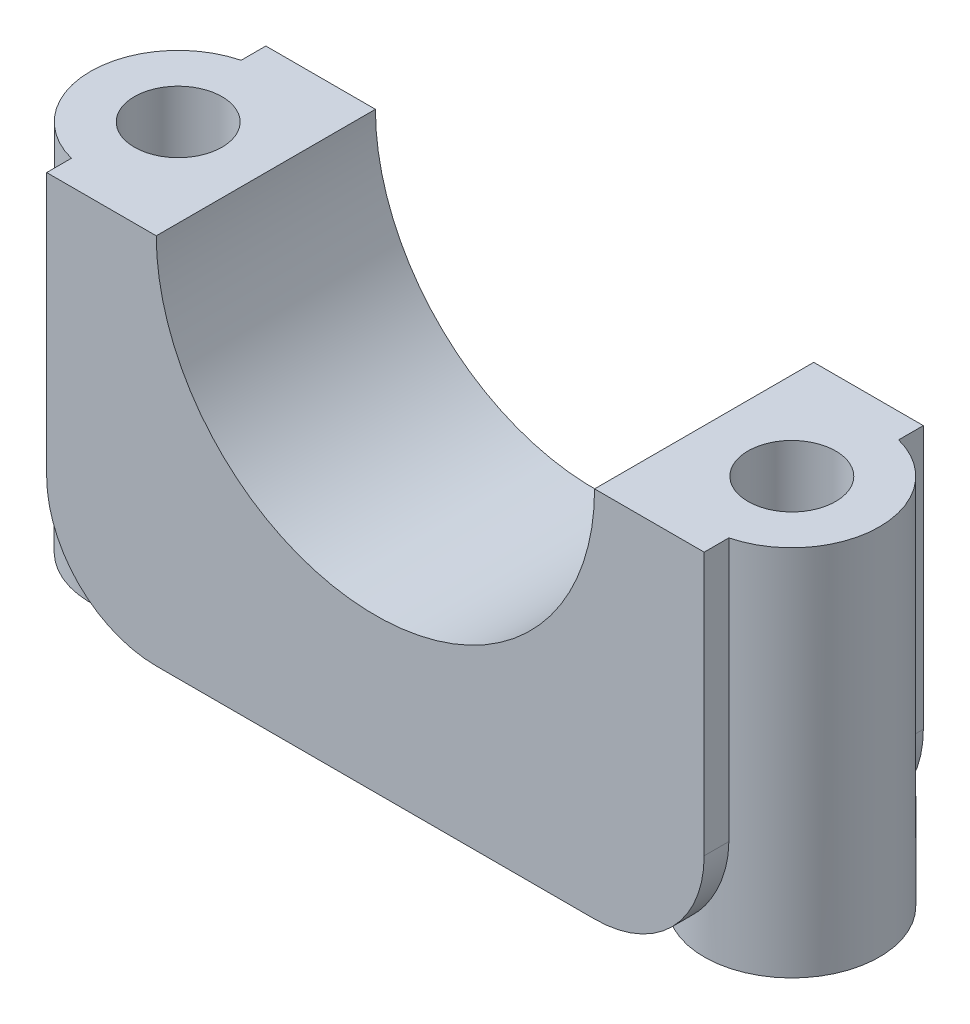
ISO-10303-21;
HEADER;
FILE_DESCRIPTION(('STEP AP214'),'2;1');
FILE_NAME('part.step','',(''),(''),'','','');
FILE_SCHEMA(('AUTOMOTIVE_DESIGN { 1 0 10303 214 1 1 1 1 }'));
ENDSEC;
DATA;
#1=APPLICATION_CONTEXT('core data for automotive mechanical design processes');
#2=APPLICATION_PROTOCOL_DEFINITION('international standard','automotive_design',2000,#1);
#3=PRODUCT_CONTEXT('',#1,'mechanical');
#4=PRODUCT('Part','Part','',(#3));
#5=PRODUCT_RELATED_PRODUCT_CATEGORY('part','',(#4));
#6=PRODUCT_DEFINITION_FORMATION('','',#4);
#7=PRODUCT_DEFINITION_CONTEXT('part definition',#1,'design');
#8=PRODUCT_DEFINITION('design','',#6,#7);
#9=PRODUCT_DEFINITION_SHAPE('','',#8);
#10=(LENGTH_UNIT() NAMED_UNIT(*) SI_UNIT(.MILLI.,.METRE.));
#11=(NAMED_UNIT(*) PLANE_ANGLE_UNIT() SI_UNIT($,.RADIAN.));
#12=(NAMED_UNIT(*) SI_UNIT($,.STERADIAN.) SOLID_ANGLE_UNIT());
#13=UNCERTAINTY_MEASURE_WITH_UNIT(LENGTH_MEASURE(1.E-05),#10,'distance_accuracy_value','');
#14=(GEOMETRIC_REPRESENTATION_CONTEXT(3) GLOBAL_UNCERTAINTY_ASSIGNED_CONTEXT((#13)) GLOBAL_UNIT_ASSIGNED_CONTEXT((#10,
#11,#12)) REPRESENTATION_CONTEXT('',''));
#15=CARTESIAN_POINT('',(0.,0.,0.));
#16=DIRECTION('',(0.,0.,1.));
#17=DIRECTION('',(1.,0.,0.));
#18=AXIS2_PLACEMENT_3D('',#15,#16,#17);
#19=CARTESIAN_POINT('',(0.,0.,0.));
#20=DIRECTION('',(0.,1.,0.));
#21=DIRECTION('',(0.,0.,1.));
#22=AXIS2_PLACEMENT_3D('',#19,#20,#21);
#23=PLANE('',#22);
#24=DIRECTION('',(0.,0.,-1.));
#25=VECTOR('',#24,1.);
#26=CARTESIAN_POINT('',(-10.,0.,10.));
#27=LINE('',#26,#25);
#28=CARTESIAN_POINT('',(-10.,0.,0.));
#29=VERTEX_POINT('',#28);
#30=CARTESIAN_POINT('',(-10.,0.,10.));
#31=VERTEX_POINT('',#30);
#32=EDGE_CURVE('E163',#29,#31,#27,.F.);
#33=ORIENTED_EDGE('',*,*,#32,.F.);
#34=DIRECTION('',(-1.,0.,0.));
#35=VECTOR('',#34,1.);
#36=CARTESIAN_POINT('',(0.,0.,0.));
#37=LINE('',#36,#35);
#38=CARTESIAN_POINT('',(-15.,0.,0.));
#39=VERTEX_POINT('',#38);
#40=EDGE_CURVE('E149',#29,#39,#37,.T.);
#41=ORIENTED_EDGE('',*,*,#40,.T.);
#42=DIRECTION('',(0.,0.,-1.));
#43=VECTOR('',#42,1.);
#44=CARTESIAN_POINT('',(-15.,0.,0.));
#45=LINE('',#44,#43);
#46=CARTESIAN_POINT('',(-15.,0.,1.12701665379258));
#47=VERTEX_POINT('',#46);
#48=EDGE_CURVE('E236',#47,#39,#45,.T.);
#49=ORIENTED_EDGE('',*,*,#48,.F.);
#50=CARTESIAN_POINT('',(-14.,0.,5.));
#51=DIRECTION('',(0.,1.,0.));
#52=DIRECTION('',(0.,0.,1.));
#53=AXIS2_PLACEMENT_3D('',#50,#51,#52);
#54=CIRCLE('',#53,4.);
#55=CARTESIAN_POINT('',(-15.,0.,8.87298334620742));
#56=VERTEX_POINT('',#55);
#57=EDGE_CURVE('E234',#56,#47,#54,.F.);
#58=ORIENTED_EDGE('',*,*,#57,.F.);
#59=DIRECTION('',(0.,0.,-1.));
#60=VECTOR('',#59,1.);
#61=CARTESIAN_POINT('',(-15.,0.,0.));
#62=LINE('',#61,#60);
#63=CARTESIAN_POINT('',(-15.,0.,10.));
#64=VERTEX_POINT('',#63);
#65=EDGE_CURVE('E228',#64,#56,#62,.T.);
#66=ORIENTED_EDGE('',*,*,#65,.F.);
#67=DIRECTION('',(-1.,0.,0.));
#68=VECTOR('',#67,1.);
#69=CARTESIAN_POINT('',(0.,0.,10.));
#70=LINE('',#69,#68);
#71=EDGE_CURVE('E187',#31,#64,#70,.T.);
#72=ORIENTED_EDGE('',*,*,#71,.F.);
#73=EDGE_LOOP('',(#33,#41,#49,#58,#66,#72));
#74=FACE_BOUND('',#73,.T.);
#75=CARTESIAN_POINT('',(-14.,0.,5.));
#76=DIRECTION('',(0.,1.,0.));
#77=DIRECTION('',(0.,0.,1.));
#78=AXIS2_PLACEMENT_3D('',#75,#76,#77);
#79=CIRCLE('',#78,2.);
#80=CARTESIAN_POINT('',(-14.,0.,7.));
#81=VERTEX_POINT('',#80);
#82=EDGE_CURVE('E153',#81,#81,#79,.F.);
#83=ORIENTED_EDGE('',*,*,#82,.T.);
#84=EDGE_LOOP('',(#83));
#85=FACE_BOUND('',#84,.T.);
#86=ADVANCED_FACE('F34',(#74,#85),#23,.T.);
#87=CARTESIAN_POINT('',(15.,0.,0.));
#88=VERTEX_POINT('',#87);
#89=CARTESIAN_POINT('',(10.,0.,0.));
#90=VERTEX_POINT('',#89);
#91=EDGE_CURVE('E241',#88,#90,#37,.T.);
#92=ORIENTED_EDGE('',*,*,#91,.T.);
#93=DIRECTION('',(0.,0.,-1.));
#94=VECTOR('',#93,1.);
#95=CARTESIAN_POINT('',(10.,0.,10.));
#96=LINE('',#95,#94);
#97=CARTESIAN_POINT('',(10.,0.,10.));
#98=VERTEX_POINT('',#97);
#99=EDGE_CURVE('E220',#98,#90,#96,.T.);
#100=ORIENTED_EDGE('',*,*,#99,.F.);
#101=CARTESIAN_POINT('',(15.,0.,10.));
#102=VERTEX_POINT('',#101);
#103=EDGE_CURVE('E238',#102,#98,#70,.T.);
#104=ORIENTED_EDGE('',*,*,#103,.F.);
#105=DIRECTION('',(0.,0.,-1.));
#106=VECTOR('',#105,1.);
#107=CARTESIAN_POINT('',(15.,0.,0.));
#108=LINE('',#107,#106);
#109=CARTESIAN_POINT('',(15.,0.,8.87298334620743));
#110=VERTEX_POINT('',#109);
#111=EDGE_CURVE('E148',#102,#110,#108,.T.);
#112=ORIENTED_EDGE('',*,*,#111,.T.);
#113=CARTESIAN_POINT('',(14.,0.,5.00000000000001));
#114=DIRECTION('',(0.,1.,0.));
#115=DIRECTION('',(0.,0.,1.));
#116=AXIS2_PLACEMENT_3D('',#113,#114,#115);
#117=CIRCLE('',#116,4.);
#118=CARTESIAN_POINT('',(15.,0.,1.12701665379259));
#119=VERTEX_POINT('',#118);
#120=EDGE_CURVE('E131',#110,#119,#117,.T.);
#121=ORIENTED_EDGE('',*,*,#120,.T.);
#122=DIRECTION('',(0.,0.,-1.));
#123=VECTOR('',#122,1.);
#124=CARTESIAN_POINT('',(15.,0.,0.));
#125=LINE('',#124,#123);
#126=EDGE_CURVE('E146',#119,#88,#125,.T.);
#127=ORIENTED_EDGE('',*,*,#126,.T.);
#128=EDGE_LOOP('',(#92,#100,#104,#112,#121,#127));
#129=FACE_BOUND('',#128,.T.);
#130=CARTESIAN_POINT('',(14.,0.,5.00000000000001));
#131=DIRECTION('',(0.,1.,0.));
#132=DIRECTION('',(0.,0.,1.));
#133=AXIS2_PLACEMENT_3D('',#130,#131,#132);
#134=CIRCLE('',#133,2.);
#135=CARTESIAN_POINT('',(14.,0.,7.00000000000001));
#136=VERTEX_POINT('',#135);
#137=EDGE_CURVE('E231',#136,#136,#134,.T.);
#138=ORIENTED_EDGE('',*,*,#137,.F.);
#139=EDGE_LOOP('',(#138));
#140=FACE_BOUND('',#139,.T.);
#141=ADVANCED_FACE('F144',(#129,#140),#23,.T.);
#142=CARTESIAN_POINT('',(0.,-17.,10.));
#143=DIRECTION('',(0.,1.,0.));
#144=DIRECTION('',(0.,0.,1.));
#145=AXIS2_PLACEMENT_3D('',#142,#143,#144);
#146=PLANE('',#145);
#147=DIRECTION('',(0.,0.,-1.));
#148=VECTOR('',#147,1.);
#149=CARTESIAN_POINT('',(9.99999999999999,-17.,10.));
#150=LINE('',#149,#148);
#151=CARTESIAN_POINT('',(10.,-17.,0.));
#152=VERTEX_POINT('',#151);
#153=CARTESIAN_POINT('',(10.,-17.,5.00000000000001));
#154=VERTEX_POINT('',#153);
#155=EDGE_CURVE('E206',#152,#154,#150,.F.);
#156=ORIENTED_EDGE('',*,*,#155,.T.);
#157=DIRECTION('',(0.,0.,-1.));
#158=VECTOR('',#157,1.);
#159=CARTESIAN_POINT('',(9.99999999999999,-17.,10.));
#160=LINE('',#159,#158);
#161=CARTESIAN_POINT('',(9.99999999999999,-17.,10.));
#162=VERTEX_POINT('',#161);
#163=EDGE_CURVE('E203',#154,#162,#160,.F.);
#164=ORIENTED_EDGE('',*,*,#163,.T.);
#165=DIRECTION('',(1.,0.,0.));
#166=VECTOR('',#165,1.);
#167=CARTESIAN_POINT('',(0.,-17.,10.));
#168=LINE('',#167,#166);
#169=CARTESIAN_POINT('',(-10.,-17.,10.));
#170=VERTEX_POINT('',#169);
#171=EDGE_CURVE('E162',#170,#162,#168,.T.);
#172=ORIENTED_EDGE('',*,*,#171,.F.);
#173=DIRECTION('',(0.,0.,-1.));
#174=VECTOR('',#173,1.);
#175=CARTESIAN_POINT('',(-10.,-17.,8.87298334620742));
#176=LINE('',#175,#174);
#177=CARTESIAN_POINT('',(-10.,-17.,5.));
#178=VERTEX_POINT('',#177);
#179=EDGE_CURVE('E202',#170,#178,#176,.T.);
#180=ORIENTED_EDGE('',*,*,#179,.T.);
#181=DIRECTION('',(0.,0.,-1.));
#182=VECTOR('',#181,1.);
#183=CARTESIAN_POINT('',(-10.,-17.,0.));
#184=LINE('',#183,#182);
#185=CARTESIAN_POINT('',(-10.,-17.,0.));
#186=VERTEX_POINT('',#185);
#187=EDGE_CURVE('E215',#178,#186,#184,.T.);
#188=ORIENTED_EDGE('',*,*,#187,.T.);
#189=DIRECTION('',(1.,0.,0.));
#190=VECTOR('',#189,1.);
#191=CARTESIAN_POINT('',(0.,-17.,0.));
#192=LINE('',#191,#190);
#193=EDGE_CURVE('E167',#186,#152,#192,.T.);
#194=ORIENTED_EDGE('',*,*,#193,.T.);
#195=EDGE_LOOP('',(#156,#164,#172,#180,#188,#194));
#196=FACE_BOUND('',#195,.T.);
#197=ADVANCED_FACE('F291',(#196),#146,.F.);
#198=CARTESIAN_POINT('',(-14.,-17.,5.));
#199=DIRECTION('',(0.,1.,0.));
#200=DIRECTION('',(0.,0.,1.));
#201=AXIS2_PLACEMENT_3D('',#198,#199,#200);
#202=CIRCLE('',#201,3.50000000000002);
#203=CARTESIAN_POINT('',(-14.,-17.,8.50000000000002));
#204=VERTEX_POINT('',#203);
#205=EDGE_CURVE('E230',#204,#204,#202,.T.);
#206=ORIENTED_EDGE('',*,*,#205,.T.);
#207=EDGE_LOOP('',(#206));
#208=FACE_BOUND('',#207,.T.);
#209=CARTESIAN_POINT('',(-14.,-17.,5.));
#210=DIRECTION('',(0.,-1.,0.));
#211=DIRECTION('',(0.,0.,-1.));
#212=AXIS2_PLACEMENT_3D('',#209,#210,#211);
#213=CIRCLE('',#212,4.);
#214=EDGE_CURVE('E174',#178,#178,#213,.T.);
#215=ORIENTED_EDGE('',*,*,#214,.T.);
#216=EDGE_LOOP('',(#215));
#217=FACE_BOUND('',#216,.T.);
#218=ADVANCED_FACE('F287',(#208,#217),#146,.F.);
#219=CARTESIAN_POINT('',(-10.,-12.,10.));
#220=DIRECTION('',(0.,0.,1.));
#221=DIRECTION('',(1.,0.,0.));
#222=AXIS2_PLACEMENT_3D('',#219,#220,#221);
#223=CYLINDRICAL_SURFACE('',#222,5.);
#224=CARTESIAN_POINT('',(-15.,-12.,1.12701665379258));
#225=CARTESIAN_POINT('',(-15.0000000910404,-12.0696068026401,1.12701946323058));
#226=CARTESIAN_POINT('',(-14.9985462281549,-12.1392047401743,1.12664094741911));
#227=CARTESIAN_POINT('',(-14.9927357909816,-12.2782681499618,1.12514661870214));
#228=CARTESIAN_POINT('',(-14.9883793544004,-12.3477336283426,1.12403084077458));
#229=CARTESIAN_POINT('',(-14.9709698333606,-12.5556967813962,1.11961712165219));
#230=CARTESIAN_POINT('',(-14.9535765254123,-12.6938340959714,1.11525274475214));
#231=CARTESIAN_POINT('',(-14.9073537354765,-12.9681088625019,1.10419852388871));
#232=CARTESIAN_POINT('',(-14.8785206401927,-13.104245668487,1.09750794526915));
#233=CARTESIAN_POINT('',(-14.8096369542677,-13.3735764447764,1.08263758324243));
#234=CARTESIAN_POINT('',(-14.7695858013634,-13.5067702672135,1.07445772519793));
#235=CARTESIAN_POINT('',(-14.678546975161,-13.7693229910669,1.05770194457319));
#236=CARTESIAN_POINT('',(-14.627560373638,-13.898682266891,1.0491260608717));
#237=CARTESIAN_POINT('',(-14.5149689456067,-14.1527566931325,1.03288007968933));
#238=CARTESIAN_POINT('',(-14.4533642162525,-14.2774718860297,1.02520997392182));
#239=CARTESIAN_POINT('',(-14.3199731726734,-14.5213353691447,1.01225592646751));
#240=CARTESIAN_POINT('',(-14.2481953492649,-14.6404881927566,1.00697001008818));
#241=CARTESIAN_POINT('',(-14.0949044630974,-14.8724679585405,1.00039071854952));
#242=CARTESIAN_POINT('',(-14.0133936433994,-14.9852963494641,0.999096425320411));
#243=CARTESIAN_POINT('',(-13.8585050335817,-15.1818732715397,1.00191069538059));
#244=CARTESIAN_POINT('',(-13.7867592403308,-15.2669258390339,1.00499082451229));
#245=CARTESIAN_POINT('',(-13.6379166362923,-15.4318940667447,1.01572335808677));
#246=CARTESIAN_POINT('',(-13.5608210695431,-15.5118109129537,1.02337470266558));
#247=CARTESIAN_POINT('',(-13.4019159901511,-15.6659528506126,1.04415496288906));
#248=CARTESIAN_POINT('',(-13.3201097997465,-15.740181869424,1.05728005790087));
#249=CARTESIAN_POINT('',(-13.1525003820703,-15.8825025287523,1.08988094310134));
#250=CARTESIAN_POINT('',(-13.0666971191381,-15.950594114497,1.10935678995866));
#251=CARTESIAN_POINT('',(-12.8913177304467,-16.0807233276987,1.15563854435403));
#252=CARTESIAN_POINT('',(-12.8017158429579,-16.1427049137024,1.18250502320863));
#253=CARTESIAN_POINT('',(-12.6206125983011,-16.259577768715,1.24414635571148));
#254=CARTESIAN_POINT('',(-12.5291112387317,-16.3144690287591,1.27892121935852));
#255=CARTESIAN_POINT('',(-12.345608912704,-16.4169170838173,1.35679837640344));
#256=CARTESIAN_POINT('',(-12.2536082225681,-16.4644775771673,1.39989644589608));
#257=CARTESIAN_POINT('',(-12.0705151031747,-16.552282232536,1.49461759758743));
#258=CARTESIAN_POINT('',(-11.9794225608339,-16.5925273165088,1.54623960395545));
#259=CARTESIAN_POINT('',(-11.8118073072826,-16.6609448528845,1.650345211475));
#260=CARTESIAN_POINT('',(-11.7349844306416,-16.6900144162476,1.70176197829075));
#261=CARTESIAN_POINT('',(-11.5839630524176,-16.7431498252179,1.81073100179287));
#262=CARTESIAN_POINT('',(-11.5097654212197,-16.7672140239894,1.86828526841175));
#263=CARTESIAN_POINT('',(-11.3648637694408,-16.8107036523738,1.98919293130654));
#264=CARTESIAN_POINT('',(-11.2941586887419,-16.8301304965426,2.05254455100867));
#265=CARTESIAN_POINT('',(-11.1569063092012,-16.8648311010726,2.1847026045927));
#266=CARTESIAN_POINT('',(-11.0903606415868,-16.880103239827,2.25351115485381));
#267=CARTESIAN_POINT('',(-10.9621300385839,-16.906994491794,2.39605588091969));
#268=CARTESIAN_POINT('',(-10.9004402790066,-16.9186172657504,2.46978702813988));
#269=CARTESIAN_POINT('',(-10.7823402429426,-16.9387784205183,2.62177757196293));
#270=CARTESIAN_POINT('',(-10.7259318550488,-16.94731570107,2.70003857235315));
#271=CARTESIAN_POINT('',(-10.5652787185896,-16.9691210311064,2.94090229861938));
#272=CARTESIAN_POINT('',(-10.4695581383993,-16.9785916615045,3.10963890274626));
#273=CARTESIAN_POINT('',(-10.2956101821103,-16.9920950973009,3.47604587699247));
#274=CARTESIAN_POINT('',(-10.2199118186502,-16.995525171661,3.67494181828907));
#275=CARTESIAN_POINT('',(-10.1307474983346,-16.998373876894,3.98011928259906));
#276=CARTESIAN_POINT('',(-10.1050897649259,-16.998940703834,4.08298532479207));
#277=CARTESIAN_POINT('',(-10.0620190430282,-16.9996629305423,4.29041835511617));
#278=CARTESIAN_POINT('',(-10.0446027230919,-16.9998184966724,4.39498463824347));
#279=CARTESIAN_POINT('',(-10.0209133063562,-16.999967253926,4.58302779804148));
#280=CARTESIAN_POINT('',(-10.0130664046355,-16.9999877287117,4.66631137091652));
#281=CARTESIAN_POINT('',(-10.0026132155353,-16.9999999823609,4.83306094094791));
#282=CARTESIAN_POINT('',(-9.99999781635649,-16.9999918111861,4.91652636700601));
#283=CARTESIAN_POINT('',(-10.,-17.,5.));
#284=B_SPLINE_CURVE_WITH_KNOTS('',3,(#224,#225,#226,#227,#228,#229,#230,#231,#232,#233,#234,
#235,#236,#237,#238,#239,#240,#241,#242,#243,#244,#245,#246,#247,#248,#249,#250,#251,#252,#253,
#254,#255,#256,#257,#258,#259,#260,#261,#262,#263,#264,#265,#266,#267,#268,#269,#270,#271,#272,
#273,#274,#275,#276,#277,#278,#279,#280,#281,#282,#283),.UNSPECIFIED.,.F.,.F.,(4,2,2,2,2,2,2,2,
2,2,2,2,2,2,2,2,2,2,2,2,2,2,2,2,2,2,2,2,2,4),(0.,0.208786623912143,0.417563343067718,
0.834898748452077,1.2523660757381,1.66985433074987,2.08730168673589,2.50474522335971,
2.92184237677553,3.33884359105913,3.67247575428561,4.00603059288007,4.33935300156623,
4.67267838461666,5.00882145880153,5.3449649579842,5.68093831541052,6.01686930103532,
6.30722974662298,6.59768557431336,6.88805268925001,7.17853297416932,7.46872093520454,
7.75901227284997,8.3393810082535,8.97493811270393,9.29272441129358,9.61038214035736,
9.86118309002806,10.1115468336227),.UNSPECIFIED.);
#285=CARTESIAN_POINT('',(-15.,-12.,1.12701665379258));
#286=VERTEX_POINT('',#285);
#287=EDGE_CURVE('E325',#286,#178,#284,.T.);
#288=ORIENTED_EDGE('',*,*,#287,.F.);
#289=DIRECTION('',(0.,0.,-1.));
#290=VECTOR('',#289,1.);
#291=CARTESIAN_POINT('',(-15.,-12.,1.12701665379258));
#292=LINE('',#291,#290);
#293=CARTESIAN_POINT('',(-15.,-12.,0.));
#294=VERTEX_POINT('',#293);
#295=EDGE_CURVE('E197',#294,#286,#292,.F.);
#296=ORIENTED_EDGE('',*,*,#295,.F.);
#297=CARTESIAN_POINT('',(-10.,-12.,0.));
#298=DIRECTION('',(0.,0.,1.));
#299=DIRECTION('',(1.,0.,0.));
#300=AXIS2_PLACEMENT_3D('',#297,#298,#299);
#301=CIRCLE('',#300,5.);
#302=EDGE_CURVE('E370',#186,#294,#301,.F.);
#303=ORIENTED_EDGE('',*,*,#302,.F.);
#304=ORIENTED_EDGE('',*,*,#187,.F.);
#305=EDGE_LOOP('',(#288,#296,#303,#304));
#306=FACE_BOUND('',#305,.T.);
#307=ADVANCED_FACE('F290',(#306),#223,.T.);
#308=CARTESIAN_POINT('',(-15.,22.8309518948453,0.));
#309=DIRECTION('',(-1.,0.,0.));
#310=DIRECTION('',(0.,0.,1.));
#311=AXIS2_PLACEMENT_3D('',#308,#309,#310);
#312=PLANE('',#311);
#313=DIRECTION('',(0.,-1.,0.));
#314=VECTOR('',#313,1.);
#315=CARTESIAN_POINT('',(-15.,22.8309518948453,1.12701665379258));
#316=LINE('',#315,#314);
#317=EDGE_CURVE('E171',#47,#286,#316,.T.);
#318=ORIENTED_EDGE('',*,*,#317,.F.);
#319=ORIENTED_EDGE('',*,*,#48,.T.);
#320=DIRECTION('',(0.,-1.,0.));
#321=VECTOR('',#320,1.);
#322=CARTESIAN_POINT('',(-15.,22.8309518948453,0.));
#323=LINE('',#322,#321);
#324=EDGE_CURVE('E173',#39,#294,#323,.T.);
#325=ORIENTED_EDGE('',*,*,#324,.T.);
#326=ORIENTED_EDGE('',*,*,#295,.T.);
#327=EDGE_LOOP('',(#318,#319,#325,#326));
#328=FACE_BOUND('',#327,.T.);
#329=ADVANCED_FACE('F297',(#328),#312,.T.);
#330=CARTESIAN_POINT('',(14.,-17.,5.00000000000001));
#331=DIRECTION('',(0.,1.,0.));
#332=DIRECTION('',(0.,0.,1.));
#333=AXIS2_PLACEMENT_3D('',#330,#331,#332);
#334=CIRCLE('',#333,3.5);
#335=CARTESIAN_POINT('',(14.,-17.,8.50000000000001));
#336=VERTEX_POINT('',#335);
#337=EDGE_CURVE('E322',#336,#336,#334,.T.);
#338=ORIENTED_EDGE('',*,*,#337,.T.);
#339=EDGE_LOOP('',(#338));
#340=FACE_BOUND('',#339,.T.);
#341=CARTESIAN_POINT('',(14.,-17.,5.00000000000001));
#342=DIRECTION('',(0.,-1.,0.));
#343=DIRECTION('',(0.,0.,-1.));
#344=AXIS2_PLACEMENT_3D('',#341,#342,#343);
#345=CIRCLE('',#344,4.);
#346=EDGE_CURVE('E170',#154,#154,#345,.F.);
#347=ORIENTED_EDGE('',*,*,#346,.F.);
#348=EDGE_LOOP('',(#347));
#349=FACE_BOUND('',#348,.T.);
#350=ADVANCED_FACE('F283',(#340,#349),#146,.F.);
#351=CARTESIAN_POINT('',(10.,-12.,0.));
#352=DIRECTION('',(0.,0.,-1.));
#353=DIRECTION('',(-1.,0.,0.));
#354=AXIS2_PLACEMENT_3D('',#351,#352,#353);
#355=CYLINDRICAL_SURFACE('',#354,5.);
#356=CARTESIAN_POINT('',(9.99999999999999,-12.,10.));
#357=DIRECTION('',(0.,0.,1.));
#358=DIRECTION('',(1.,0.,0.));
#359=AXIS2_PLACEMENT_3D('',#356,#357,#358);
#360=CIRCLE('',#359,5.);
#361=CARTESIAN_POINT('',(15.,-12.,10.));
#362=VERTEX_POINT('',#361);
#363=EDGE_CURVE('E204',#162,#362,#360,.T.);
#364=ORIENTED_EDGE('',*,*,#363,.F.);
#365=ORIENTED_EDGE('',*,*,#163,.F.);
#366=CARTESIAN_POINT('',(15.,-12.,8.87298334620743));
#367=CARTESIAN_POINT('',(15.0000000910404,-12.0696068026401,8.87298053676943));
#368=CARTESIAN_POINT('',(14.9985462281549,-12.1392047401743,8.8733590525809));
#369=CARTESIAN_POINT('',(14.9927357909816,-12.2782681499618,8.87485338129787));
#370=CARTESIAN_POINT('',(14.9883793544004,-12.3477336283426,8.87596915922543));
#371=CARTESIAN_POINT('',(14.9709698333606,-12.5556967813962,8.88038287834781));
#372=CARTESIAN_POINT('',(14.9535765254123,-12.6938340959714,8.88474725524787));
#373=CARTESIAN_POINT('',(14.9073537354765,-12.9681088625019,8.8958014761113));
#374=CARTESIAN_POINT('',(14.8785206401927,-13.104245668487,8.90249205473086));
#375=CARTESIAN_POINT('',(14.8096369542677,-13.3735764447764,8.91736241675758));
#376=CARTESIAN_POINT('',(14.7695858013634,-13.5067702672135,8.92554227480207));
#377=CARTESIAN_POINT('',(14.678546975161,-13.7693229910669,8.94229805542682));
#378=CARTESIAN_POINT('',(14.6275603736379,-13.898682266891,8.95087393912831));
#379=CARTESIAN_POINT('',(14.5149689456067,-14.1527566931325,8.96711992031068));
#380=CARTESIAN_POINT('',(14.4533642162525,-14.2774718860297,8.97479002607819));
#381=CARTESIAN_POINT('',(14.3199731726734,-14.5213353691447,8.9877440735325));
#382=CARTESIAN_POINT('',(14.2481953492649,-14.6404881927566,8.99302998991183));
#383=CARTESIAN_POINT('',(14.0949044630974,-14.8724679585405,8.99960928145048));
#384=CARTESIAN_POINT('',(14.0133936433994,-14.9852963494641,9.0009035746796));
#385=CARTESIAN_POINT('',(13.8585050335817,-15.1818732715397,8.99808930461942));
#386=CARTESIAN_POINT('',(13.7867592403307,-15.2669258390339,8.99500917548771));
#387=CARTESIAN_POINT('',(13.6379166362923,-15.4318940667447,8.98427664191324));
#388=CARTESIAN_POINT('',(13.5608210695431,-15.5118109129537,8.97662529733443));
#389=CARTESIAN_POINT('',(13.4019159901511,-15.6659528506126,8.95584503711095));
#390=CARTESIAN_POINT('',(13.3201097997465,-15.740181869424,8.94271994209914));
#391=CARTESIAN_POINT('',(13.1525003820703,-15.8825025287523,8.91011905689866));
#392=CARTESIAN_POINT('',(13.0666971191381,-15.950594114497,8.89064321004135));
#393=CARTESIAN_POINT('',(12.8913177304467,-16.0807233276987,8.84436145564598));
#394=CARTESIAN_POINT('',(12.8017158429579,-16.1427049137024,8.81749497679137));
#395=CARTESIAN_POINT('',(12.6206125983011,-16.259577768715,8.75585364428853));
#396=CARTESIAN_POINT('',(12.5291112387317,-16.3144690287591,8.72107878064148));
#397=CARTESIAN_POINT('',(12.345608912704,-16.4169170838173,8.64320162359656));
#398=CARTESIAN_POINT('',(12.2536082225681,-16.4644775771673,8.60010355410393));
#399=CARTESIAN_POINT('',(12.0705151031747,-16.552282232536,8.50538240241258));
#400=CARTESIAN_POINT('',(11.9794225608338,-16.5925273165088,8.45376039604456));
#401=CARTESIAN_POINT('',(11.8118073072826,-16.6609448528845,8.34965478852501));
#402=CARTESIAN_POINT('',(11.7349844306416,-16.6900144162476,8.29823802170926));
#403=CARTESIAN_POINT('',(11.5839630524176,-16.7431498252179,8.18926899820714));
#404=CARTESIAN_POINT('',(11.5097654212197,-16.7672140239894,8.13171473158825));
#405=CARTESIAN_POINT('',(11.3648637694408,-16.8107036523738,8.01080706869346));
#406=CARTESIAN_POINT('',(11.2941586887418,-16.8301304965426,7.94745544899133));
#407=CARTESIAN_POINT('',(11.1569063092012,-16.8648311010726,7.8152973954073));
#408=CARTESIAN_POINT('',(11.0903606415868,-16.880103239827,7.74648884514619));
#409=CARTESIAN_POINT('',(10.9621300385839,-16.906994491794,7.60394411908031));
#410=CARTESIAN_POINT('',(10.9004402790066,-16.9186172657504,7.53021297186012));
#411=CARTESIAN_POINT('',(10.7823402429426,-16.9387784205183,7.37822242803708));
#412=CARTESIAN_POINT('',(10.7259318550488,-16.94731570107,7.29996142764686));
#413=CARTESIAN_POINT('',(10.5652787185896,-16.9691210311064,7.05909770138063));
#414=CARTESIAN_POINT('',(10.4695581383993,-16.9785916615044,6.89036109725375));
#415=CARTESIAN_POINT('',(10.2956101821103,-16.9920950973009,6.52395412300754));
#416=CARTESIAN_POINT('',(10.2199118186502,-16.995525171661,6.32505818171093));
#417=CARTESIAN_POINT('',(10.1307474983346,-16.998373876894,6.01988071740094));
#418=CARTESIAN_POINT('',(10.1050897649259,-16.998940703834,5.91701467520793));
#419=CARTESIAN_POINT('',(10.0620190430282,-16.9996629305423,5.70958164488384));
#420=CARTESIAN_POINT('',(10.0446027230919,-16.9998184966724,5.60501536175653));
#421=CARTESIAN_POINT('',(10.0209133063562,-16.999967253926,5.41697220195853));
#422=CARTESIAN_POINT('',(10.0130664046355,-16.9999877287117,5.33368862908349));
#423=CARTESIAN_POINT('',(10.0026132155353,-16.9999999823609,5.1669390590521));
#424=CARTESIAN_POINT('',(9.99999781635649,-16.9999918111861,5.08347363299399));
#425=CARTESIAN_POINT('',(10.,-17.,5.00000000000001));
#426=B_SPLINE_CURVE_WITH_KNOTS('',3,(#366,#367,#368,#369,#370,#371,#372,#373,#374,#375,#376,
#377,#378,#379,#380,#381,#382,#383,#384,#385,#386,#387,#388,#389,#390,#391,#392,#393,#394,#395,
#396,#397,#398,#399,#400,#401,#402,#403,#404,#405,#406,#407,#408,#409,#410,#411,#412,#413,#414,
#415,#416,#417,#418,#419,#420,#421,#422,#423,#424,#425),.UNSPECIFIED.,.F.,.F.,(4,2,2,2,2,2,2,2,
2,2,2,2,2,2,2,2,2,2,2,2,2,2,2,2,2,2,2,2,2,4),(0.,0.208786623912143,0.417563343067718,
0.834898748452077,1.2523660757381,1.66985433074987,2.08730168673589,2.50474522335971,
2.92184237677553,3.33884359105913,3.67247575428561,4.00603059288007,4.33935300156623,
4.67267838461666,5.00882145880153,5.3449649579842,5.68093831541052,6.01686930103532,
6.30722974662298,6.59768557431336,6.88805268925001,7.17853297416932,7.46872093520454,
7.75901227284996,8.3393810082535,8.97493811270394,9.29272441129358,9.61038214035736,
9.86118309002806,10.1115468336227),.UNSPECIFIED.);
#427=CARTESIAN_POINT('',(15.,-12.,8.87298334620743));
#428=VERTEX_POINT('',#427);
#429=EDGE_CURVE('E259',#428,#154,#426,.T.);
#430=ORIENTED_EDGE('',*,*,#429,.F.);
#431=DIRECTION('',(0.,0.,-1.));
#432=VECTOR('',#431,1.);
#433=CARTESIAN_POINT('',(15.,-12.,0.));
#434=LINE('',#433,#432);
#435=EDGE_CURVE('E218',#362,#428,#434,.T.);
#436=ORIENTED_EDGE('',*,*,#435,.F.);
#437=EDGE_LOOP('',(#364,#365,#430,#436));
#438=FACE_BOUND('',#437,.T.);
#439=ADVANCED_FACE('F257',(#438),#355,.T.);
#440=CARTESIAN_POINT('',(-10.,-12.,10.));
#441=DIRECTION('',(0.,0.,1.));
#442=DIRECTION('',(1.,0.,0.));
#443=AXIS2_PLACEMENT_3D('',#440,#441,#442);
#444=CYLINDRICAL_SURFACE('',#443,5.);
#445=CARTESIAN_POINT('',(-10.,-12.,10.));
#446=DIRECTION('',(0.,0.,1.));
#447=DIRECTION('',(1.,0.,0.));
#448=AXIS2_PLACEMENT_3D('',#445,#446,#447);
#449=CIRCLE('',#448,5.);
#450=CARTESIAN_POINT('',(-15.,-12.,10.));
#451=VERTEX_POINT('',#450);
#452=EDGE_CURVE('E183',#451,#170,#449,.T.);
#453=ORIENTED_EDGE('',*,*,#452,.F.);
#454=DIRECTION('',(0.,0.,-1.));
#455=VECTOR('',#454,1.);
#456=CARTESIAN_POINT('',(-15.,-12.,10.));
#457=LINE('',#456,#455);
#458=CARTESIAN_POINT('',(-15.,-12.,8.87298334620742));
#459=VERTEX_POINT('',#458);
#460=EDGE_CURVE('E190',#459,#451,#457,.F.);
#461=ORIENTED_EDGE('',*,*,#460,.F.);
#462=CARTESIAN_POINT('',(-10.,-17.,5.));
#463=CARTESIAN_POINT('',(-9.99998822124218,-16.9999721292244,5.11176601524956));
#464=CARTESIAN_POINT('',(-10.0046838767994,-16.999999123703,5.2235303675028));
#465=CARTESIAN_POINT('',(-10.0234052011184,-16.9999614275837,5.44627277629985));
#466=CARTESIAN_POINT('',(-10.0374306754634,-16.9998967388963,5.55725084917963));
#467=CARTESIAN_POINT('',(-10.0747423641927,-16.9994741000567,5.77773449290645));
#468=CARTESIAN_POINT('',(-10.0980363037769,-16.9991159050046,5.88723875643188));
#469=CARTESIAN_POINT('',(-10.1537159244512,-16.9977146336714,6.1039057554715));
#470=CARTESIAN_POINT('',(-10.1861014913368,-16.9966715659933,6.2110685203802));
#471=CARTESIAN_POINT('',(-10.2597584131308,-16.9933839364963,6.42236411090877));
#472=CARTESIAN_POINT('',(-10.3010360593716,-16.9911385223124,6.52649473170152));
#473=CARTESIAN_POINT('',(-10.3921699398544,-16.9848058161378,6.73092164192847));
#474=CARTESIAN_POINT('',(-10.4420291829413,-16.9807178773121,6.83121657138272));
#475=CARTESIAN_POINT('',(-10.5498796969908,-16.9699663593304,7.02710675095296));
#476=CARTESIAN_POINT('',(-10.6078654204632,-16.963304531818,7.12270514750073));
#477=CARTESIAN_POINT('',(-10.7314794488403,-16.9465973509581,7.30851062589638));
#478=CARTESIAN_POINT('',(-10.797107035867,-16.9365523152623,7.39871821295504));
#479=CARTESIAN_POINT('',(-10.9335994088482,-16.9125419833084,7.57078541839489));
#480=CARTESIAN_POINT('',(-11.0042885877563,-16.8986828673471,7.65279898302948));
#481=CARTESIAN_POINT('',(-11.1515258361838,-16.8661757684504,7.81030406900943));
#482=CARTESIAN_POINT('',(-11.2280711600846,-16.8475300201566,7.88579861184433));
#483=CARTESIAN_POINT('',(-11.3860815953541,-16.8047342414779,8.02965990486143));
#484=CARTESIAN_POINT('',(-11.4675437745936,-16.7805874682083,8.09803083810812));
#485=CARTESIAN_POINT('',(-11.6343374299454,-16.7261645005922,8.2271910762938));
#486=CARTESIAN_POINT('',(-11.7196684930146,-16.6958889593643,8.28798118797659));
#487=CARTESIAN_POINT('',(-11.8847743450382,-16.6319226062855,8.39626687502187));
#488=CARTESIAN_POINT('',(-11.9643122349183,-16.5988248531514,8.44447590279568));
#489=CARTESIAN_POINT('',(-12.1245729555588,-16.5270185545047,8.53429053173251));
#490=CARTESIAN_POINT('',(-12.2052957389182,-16.4883102328923,8.57589639626836));
#491=CARTESIAN_POINT('',(-12.3669247105626,-16.4052155112329,8.65254239457018));
#492=CARTESIAN_POINT('',(-12.4478308893459,-16.3608293990336,8.68758286096114));
#493=CARTESIAN_POINT('',(-12.6088651198048,-16.2664427927572,8.75129888416901));
#494=CARTESIAN_POINT('',(-12.6889931627533,-16.2164422357892,8.77997436967716));
#495=CARTESIAN_POINT('',(-12.8448232786205,-16.1128366484985,8.83040978535506));
#496=CARTESIAN_POINT('',(-12.9205824206015,-16.0594170897535,8.85237529048944));
#497=CARTESIAN_POINT('',(-13.0698483588886,-15.9477508919513,8.89111433326006));
#498=CARTESIAN_POINT('',(-13.1433544253583,-15.8895027109322,8.90788620421271));
#499=CARTESIAN_POINT('',(-13.3595212432978,-15.7079543654574,8.95112043894012));
#500=CARTESIAN_POINT('',(-13.4979239123643,-15.5777887650728,8.97053001696776));
#501=CARTESIAN_POINT('',(-13.7754544062025,-15.2850479946647,8.99642006946508));
#502=CARTESIAN_POINT('',(-13.9125996906286,-15.1204560401251,9.00102841404927));
#503=CARTESIAN_POINT('',(-14.1647449006176,-14.7750086913105,8.99859769336934));
#504=CARTESIAN_POINT('',(-14.279723166461,-14.5941376410199,8.9915472999423));
#505=CARTESIAN_POINT('',(-14.4444015087813,-14.2943036686896,8.9757205491533));
#506=CARTESIAN_POINT('',(-14.5018512779539,-14.1794082404466,8.96875295972883));
#507=CARTESIAN_POINT('',(-14.607724369048,-13.9455925518977,8.95392599904897));
#508=CARTESIAN_POINT('',(-14.6561494015471,-13.8266730593853,8.9460667972479));
#509=CARTESIAN_POINT('',(-14.743696354654,-13.5854963034178,8.93050808385472));
#510=CARTESIAN_POINT('',(-14.7828214944563,-13.4632402113243,8.92280851784893));
#511=CARTESIAN_POINT('',(-14.8515599813311,-13.2160682026214,8.90846195342497));
#512=CARTESIAN_POINT('',(-14.8811759153559,-13.0911530192875,8.90181466898653));
#513=CARTESIAN_POINT('',(-14.937191727298,-12.8064160939071,8.88879459540219));
#514=CARTESIAN_POINT('',(-14.9607354477639,-12.6459919512913,8.88294612879771));
#515=CARTESIAN_POINT('',(-14.9842865474507,-12.4042843016829,8.87701366976184));
#516=CARTESIAN_POINT('',(-14.9901761623747,-12.3235626510531,8.87550958449156));
#517=CARTESIAN_POINT('',(-14.9980332188916,-12.1618993505118,8.8734918643761));
#518=CARTESIAN_POINT('',(-14.9999998324211,-12.0809576577637,8.87297843863917));
#519=CARTESIAN_POINT('',(-15.,-12.,8.87298334620742));
#520=B_SPLINE_CURVE_WITH_KNOTS('',3,(#462,#463,#464,#465,#466,#467,#468,#469,#470,#471,#472,
#473,#474,#475,#476,#477,#478,#479,#480,#481,#482,#483,#484,#485,#486,#487,#488,#489,#490,#491,
#492,#493,#494,#495,#496,#497,#498,#499,#500,#501,#502,#503,#504,#505,#506,#507,#508,#509,#510,
#511,#512,#513,#514,#515,#516,#517,#518,#519),.UNSPECIFIED.,.F.,.F.,(4,2,2,2,2,2,2,2,2,2,2,2,2,
2,2,2,2,2,2,2,2,2,2,2,2,2,2,2,4),(0.,0.335197094680652,0.670387204668536,1.00585728043153,
1.34132314237672,1.677027137587,2.01284907664179,2.34844287562308,2.68400517426022,
3.0110347220633,3.33791187272177,3.66459598258526,3.99124529731524,4.28702812897907,
4.58279916012431,4.87855520246696,5.1743145580846,5.4598030729874,5.74538310898724,
6.3162005732567,6.95684793050019,7.59811813584301,7.98372406349472,8.36925682765762,
8.75465594315494,9.13995012291357,9.62579163625469,9.86855625880559,10.1113721184673),.UNSPECIFIED.);
#521=EDGE_CURVE('E263',#178,#459,#520,.T.);
#522=ORIENTED_EDGE('',*,*,#521,.F.);
#523=ORIENTED_EDGE('',*,*,#179,.F.);
#524=EDGE_LOOP('',(#453,#461,#522,#523));
#525=FACE_BOUND('',#524,.T.);
#526=ADVANCED_FACE('F200',(#525),#444,.T.);
#527=CARTESIAN_POINT('',(-14.,22.8309518948453,5.));
#528=DIRECTION('',(0.,-1.,0.));
#529=DIRECTION('',(0.,0.,-1.));
#530=AXIS2_PLACEMENT_3D('',#527,#528,#529);
#531=CYLINDRICAL_SURFACE('',#530,4.);
#532=DIRECTION('',(0.,-1.,0.));
#533=VECTOR('',#532,1.);
#534=CARTESIAN_POINT('',(-15.,22.8309518948453,8.87298334620742));
#535=LINE('',#534,#533);
#536=EDGE_CURVE('E11',#56,#459,#535,.T.);
#537=ORIENTED_EDGE('',*,*,#536,.F.);
#538=ORIENTED_EDGE('',*,*,#57,.T.);
#539=ORIENTED_EDGE('',*,*,#317,.T.);
#540=ORIENTED_EDGE('',*,*,#287,.T.);
#541=ORIENTED_EDGE('',*,*,#214,.F.);
#542=ORIENTED_EDGE('',*,*,#521,.T.);
#543=EDGE_LOOP('',(#537,#538,#539,#540,#541,#542));
#544=FACE_BOUND('',#543,.T.);
#545=ADVANCED_FACE('F301',(#544),#531,.T.);
#546=CARTESIAN_POINT('',(0.,0.,0.));
#547=DIRECTION('',(0.,0.,1.));
#548=DIRECTION('',(1.,0.,0.));
#549=AXIS2_PLACEMENT_3D('',#546,#547,#548);
#550=PLANE('',#549);
#551=ORIENTED_EDGE('',*,*,#91,.F.);
#552=DIRECTION('',(0.,-1.,0.));
#553=VECTOR('',#552,1.);
#554=CARTESIAN_POINT('',(15.,22.8309518948453,0.));
#555=LINE('',#554,#553);
#556=CARTESIAN_POINT('',(15.,-12.,0.));
#557=VERTEX_POINT('',#556);
#558=EDGE_CURVE('E139',#88,#557,#555,.T.);
#559=ORIENTED_EDGE('',*,*,#558,.T.);
#560=CARTESIAN_POINT('',(10.,-12.,0.));
#561=DIRECTION('',(0.,0.,1.));
#562=DIRECTION('',(1.,0.,0.));
#563=AXIS2_PLACEMENT_3D('',#560,#561,#562);
#564=CIRCLE('',#563,5.);
#565=EDGE_CURVE('E196',#557,#152,#564,.F.);
#566=ORIENTED_EDGE('',*,*,#565,.T.);
#567=ORIENTED_EDGE('',*,*,#193,.F.);
#568=ORIENTED_EDGE('',*,*,#302,.T.);
#569=ORIENTED_EDGE('',*,*,#324,.F.);
#570=ORIENTED_EDGE('',*,*,#40,.F.);
#571=CARTESIAN_POINT('',(0.,0.,0.));
#572=DIRECTION('',(0.,0.,1.));
#573=DIRECTION('',(1.,0.,0.));
#574=AXIS2_PLACEMENT_3D('',#571,#572,#573);
#575=CIRCLE('',#574,10.);
#576=EDGE_CURVE('E164',#29,#90,#575,.T.);
#577=ORIENTED_EDGE('',*,*,#576,.T.);
#578=EDGE_LOOP('',(#551,#559,#566,#567,#568,#569,#570,#577));
#579=FACE_BOUND('',#578,.T.);
#580=ADVANCED_FACE('F248',(#579),#550,.F.);
#581=CARTESIAN_POINT('',(0.,0.,10.));
#582=DIRECTION('',(0.,0.,1.));
#583=DIRECTION('',(1.,0.,0.));
#584=AXIS2_PLACEMENT_3D('',#581,#582,#583);
#585=PLANE('',#584);
#586=DIRECTION('',(0.,-1.,0.));
#587=VECTOR('',#586,1.);
#588=CARTESIAN_POINT('',(15.,22.8309518948453,10.));
#589=LINE('',#588,#587);
#590=EDGE_CURVE('E49',#102,#362,#589,.T.);
#591=ORIENTED_EDGE('',*,*,#590,.F.);
#592=ORIENTED_EDGE('',*,*,#103,.T.);
#593=CARTESIAN_POINT('',(0.,0.,10.));
#594=DIRECTION('',(0.,0.,1.));
#595=DIRECTION('',(1.,0.,0.));
#596=AXIS2_PLACEMENT_3D('',#593,#594,#595);
#597=CIRCLE('',#596,10.);
#598=EDGE_CURVE('E159',#31,#98,#597,.T.);
#599=ORIENTED_EDGE('',*,*,#598,.F.);
#600=ORIENTED_EDGE('',*,*,#71,.T.);
#601=DIRECTION('',(0.,-1.,0.));
#602=VECTOR('',#601,1.);
#603=CARTESIAN_POINT('',(-15.,22.8309518948453,10.));
#604=LINE('',#603,#602);
#605=EDGE_CURVE('E42',#64,#451,#604,.T.);
#606=ORIENTED_EDGE('',*,*,#605,.T.);
#607=ORIENTED_EDGE('',*,*,#452,.T.);
#608=ORIENTED_EDGE('',*,*,#171,.T.);
#609=ORIENTED_EDGE('',*,*,#363,.T.);
#610=EDGE_LOOP('',(#591,#592,#599,#600,#606,#607,#608,#609));
#611=FACE_BOUND('',#610,.T.);
#612=ADVANCED_FACE('F180',(#611),#585,.T.);
#613=CARTESIAN_POINT('',(0.,0.,10.));
#614=DIRECTION('',(0.,0.,-1.));
#615=DIRECTION('',(-1.,0.,0.));
#616=AXIS2_PLACEMENT_3D('',#613,#614,#615);
#617=CYLINDRICAL_SURFACE('',#616,10.);
#618=ORIENTED_EDGE('',*,*,#598,.T.);
#619=ORIENTED_EDGE('',*,*,#99,.T.);
#620=ORIENTED_EDGE('',*,*,#576,.F.);
#621=ORIENTED_EDGE('',*,*,#32,.T.);
#622=EDGE_LOOP('',(#618,#619,#620,#621));
#623=FACE_BOUND('',#622,.T.);
#624=ADVANCED_FACE('F252',(#623),#617,.F.);
#625=CARTESIAN_POINT('',(-15.,22.8309518948453,0.));
#626=DIRECTION('',(-1.,0.,0.));
#627=DIRECTION('',(0.,0.,1.));
#628=AXIS2_PLACEMENT_3D('',#625,#626,#627);
#629=PLANE('',#628);
#630=ORIENTED_EDGE('',*,*,#605,.F.);
#631=ORIENTED_EDGE('',*,*,#65,.T.);
#632=ORIENTED_EDGE('',*,*,#536,.T.);
#633=ORIENTED_EDGE('',*,*,#460,.T.);
#634=EDGE_LOOP('',(#630,#631,#632,#633));
#635=FACE_BOUND('',#634,.T.);
#636=ADVANCED_FACE('F191',(#635),#629,.T.);
#637=CARTESIAN_POINT('',(10.,-12.,0.));
#638=DIRECTION('',(0.,0.,-1.));
#639=DIRECTION('',(-1.,0.,0.));
#640=AXIS2_PLACEMENT_3D('',#637,#638,#639);
#641=CYLINDRICAL_SURFACE('',#640,5.);
#642=CARTESIAN_POINT('',(10.,-17.,5.00000000000001));
#643=CARTESIAN_POINT('',(9.99998822124218,-16.9999721292244,4.88823398475044));
#644=CARTESIAN_POINT('',(10.0046838767994,-16.999999123703,4.7764696324972));
#645=CARTESIAN_POINT('',(10.0234052011184,-16.9999614275837,4.55372722370015));
#646=CARTESIAN_POINT('',(10.0374306754633,-16.9998967388963,4.44274915082038));
#647=CARTESIAN_POINT('',(10.0747423641927,-16.9994741000567,4.22226550709355));
#648=CARTESIAN_POINT('',(10.0980363037769,-16.9991159050046,4.11276124356813));
#649=CARTESIAN_POINT('',(10.1537159244512,-16.9977146336714,3.89609424452851));
#650=CARTESIAN_POINT('',(10.1861014913368,-16.9966715659933,3.78893147961981));
#651=CARTESIAN_POINT('',(10.2597584131308,-16.9933839364963,3.57763588909124));
#652=CARTESIAN_POINT('',(10.3010360593716,-16.9911385223124,3.47350526829849));
#653=CARTESIAN_POINT('',(10.3921699398544,-16.9848058161378,3.26907835807154));
#654=CARTESIAN_POINT('',(10.4420291829413,-16.9807178773121,3.16878342861729));
#655=CARTESIAN_POINT('',(10.5498796969908,-16.9699663593304,2.97289324904705));
#656=CARTESIAN_POINT('',(10.6078654204632,-16.963304531818,2.87729485249928));
#657=CARTESIAN_POINT('',(10.7314794488403,-16.9465973509581,2.69148937410363));
#658=CARTESIAN_POINT('',(10.797107035867,-16.9365523152623,2.60128178704496));
#659=CARTESIAN_POINT('',(10.9335994088482,-16.9125419833084,2.42921458160512));
#660=CARTESIAN_POINT('',(11.0042885877563,-16.8986828673471,2.34720101697053));
#661=CARTESIAN_POINT('',(11.1515258361838,-16.8661757684503,2.18969593099058));
#662=CARTESIAN_POINT('',(11.2280711600846,-16.8475300201566,2.11420138815567));
#663=CARTESIAN_POINT('',(11.3860815953541,-16.8047342414779,1.97034009513858));
#664=CARTESIAN_POINT('',(11.4675437745936,-16.7805874682083,1.90196916189188));
#665=CARTESIAN_POINT('',(11.6343374299454,-16.7261645005922,1.77280892370621));
#666=CARTESIAN_POINT('',(11.7196684930146,-16.6958889593643,1.71201881202342));
#667=CARTESIAN_POINT('',(11.8847743450382,-16.6319226062855,1.60373312497814));
#668=CARTESIAN_POINT('',(11.9643122349183,-16.5988248531514,1.55552409720433));
#669=CARTESIAN_POINT('',(12.1245729555588,-16.5270185545047,1.4657094682675));
#670=CARTESIAN_POINT('',(12.2052957389182,-16.4883102328923,1.42410360373165));
#671=CARTESIAN_POINT('',(12.3669247105626,-16.4052155112329,1.34745760542983));
#672=CARTESIAN_POINT('',(12.4478308893459,-16.3608293990336,1.31241713903887));
#673=CARTESIAN_POINT('',(12.6088651198048,-16.2664427927572,1.248701115831));
#674=CARTESIAN_POINT('',(12.6889931627533,-16.2164422357892,1.22002563032285));
#675=CARTESIAN_POINT('',(12.8448232786205,-16.1128366484985,1.16959021464495));
#676=CARTESIAN_POINT('',(12.9205824206015,-16.0594170897535,1.14762470951057));
#677=CARTESIAN_POINT('',(13.0698483588886,-15.9477508919513,1.10888566673996));
#678=CARTESIAN_POINT('',(13.1433544253583,-15.8895027109322,1.0921137957873));
#679=CARTESIAN_POINT('',(13.3595212432978,-15.7079543654574,1.0488795610599));
#680=CARTESIAN_POINT('',(13.4979239123643,-15.5777887650728,1.02946998303224));
#681=CARTESIAN_POINT('',(13.7754544062025,-15.2850479946647,1.00357993053493));
#682=CARTESIAN_POINT('',(13.9125996906286,-15.1204560401251,0.998971585950742));
#683=CARTESIAN_POINT('',(14.1647449006176,-14.7750086913105,1.00140230663067));
#684=CARTESIAN_POINT('',(14.279723166461,-14.5941376410199,1.00845270005771));
#685=CARTESIAN_POINT('',(14.4444015087813,-14.2943036686896,1.02427945084671));
#686=CARTESIAN_POINT('',(14.5018512779539,-14.1794082404466,1.03124704027118));
#687=CARTESIAN_POINT('',(14.607724369048,-13.9455925518977,1.04607400095105));
#688=CARTESIAN_POINT('',(14.6561494015471,-13.8266730593853,1.05393320275211));
#689=CARTESIAN_POINT('',(14.743696354654,-13.5854963034178,1.06949191614529));
#690=CARTESIAN_POINT('',(14.7828214944563,-13.4632402113243,1.07719148215109));
#691=CARTESIAN_POINT('',(14.8515599813311,-13.2160682026214,1.09153804657504));
#692=CARTESIAN_POINT('',(14.8811759153559,-13.0911530192875,1.09818533101348));
#693=CARTESIAN_POINT('',(14.937191727298,-12.8064160939071,1.11120540459782));
#694=CARTESIAN_POINT('',(14.9607354477639,-12.6459919512913,1.1170538712023));
#695=CARTESIAN_POINT('',(14.9842865474507,-12.4042843016829,1.12298633023817));
#696=CARTESIAN_POINT('',(14.9901761623747,-12.3235626510531,1.12449041550845));
#697=CARTESIAN_POINT('',(14.9980332188916,-12.1618993505118,1.12650813562391));
#698=CARTESIAN_POINT('',(14.9999998324211,-12.0809576577637,1.12702156136084));
#699=CARTESIAN_POINT('',(15.,-12.,1.12701665379259));
#700=B_SPLINE_CURVE_WITH_KNOTS('',3,(#642,#643,#644,#645,#646,#647,#648,#649,#650,#651,#652,
#653,#654,#655,#656,#657,#658,#659,#660,#661,#662,#663,#664,#665,#666,#667,#668,#669,#670,#671,
#672,#673,#674,#675,#676,#677,#678,#679,#680,#681,#682,#683,#684,#685,#686,#687,#688,#689,#690,
#691,#692,#693,#694,#695,#696,#697,#698,#699),.UNSPECIFIED.,.F.,.F.,(4,2,2,2,2,2,2,2,2,2,2,2,2,
2,2,2,2,2,2,2,2,2,2,2,2,2,2,2,4),(0.,0.335197094680652,0.670387204668536,1.00585728043153,
1.34132314237672,1.677027137587,2.01284907664178,2.34844287562308,2.68400517426022,
3.0110347220633,3.33791187272177,3.66459598258526,3.99124529731523,4.28702812897907,
4.58279916012431,4.87855520246696,5.1743145580846,5.45980307298739,5.74538310898723,
6.31620057325669,6.95684793050019,7.59811813584301,7.98372406349471,8.36925682765762,
8.75465594315494,9.13995012291357,9.62579163625469,9.86855625880559,10.1113721184673),.UNSPECIFIED.);
#701=CARTESIAN_POINT('',(15.,-12.,1.12701665379259));
#702=VERTEX_POINT('',#701);
#703=EDGE_CURVE('E134',#154,#702,#700,.T.);
#704=ORIENTED_EDGE('',*,*,#703,.F.);
#705=ORIENTED_EDGE('',*,*,#155,.F.);
#706=ORIENTED_EDGE('',*,*,#565,.F.);
#707=DIRECTION('',(0.,0.,-1.));
#708=VECTOR('',#707,1.);
#709=CARTESIAN_POINT('',(15.,-12.,0.));
#710=LINE('',#709,#708);
#711=EDGE_CURVE('E208',#702,#557,#710,.T.);
#712=ORIENTED_EDGE('',*,*,#711,.F.);
#713=EDGE_LOOP('',(#704,#705,#706,#712));
#714=FACE_BOUND('',#713,.T.);
#715=ADVANCED_FACE('F284',(#714),#641,.T.);
#716=CARTESIAN_POINT('',(14.,22.8309518948453,5.00000000000001));
#717=DIRECTION('',(0.,-1.,0.));
#718=DIRECTION('',(0.,0.,-1.));
#719=AXIS2_PLACEMENT_3D('',#716,#717,#718);
#720=CYLINDRICAL_SURFACE('',#719,4.);
#721=ORIENTED_EDGE('',*,*,#120,.F.);
#722=DIRECTION('',(0.,-1.,0.));
#723=VECTOR('',#722,1.);
#724=CARTESIAN_POINT('',(15.,22.8309518948453,8.87298334620743));
#725=LINE('',#724,#723);
#726=EDGE_CURVE('E57',#110,#428,#725,.T.);
#727=ORIENTED_EDGE('',*,*,#726,.T.);
#728=ORIENTED_EDGE('',*,*,#429,.T.);
#729=ORIENTED_EDGE('',*,*,#346,.T.);
#730=ORIENTED_EDGE('',*,*,#703,.T.);
#731=DIRECTION('',(0.,-1.,0.));
#732=VECTOR('',#731,1.);
#733=CARTESIAN_POINT('',(15.,22.8309518948453,1.12701665379259));
#734=LINE('',#733,#732);
#735=EDGE_CURVE('E128',#119,#702,#734,.T.);
#736=ORIENTED_EDGE('',*,*,#735,.F.);
#737=EDGE_LOOP('',(#721,#727,#728,#729,#730,#736));
#738=FACE_BOUND('',#737,.T.);
#739=ADVANCED_FACE('F130',(#738),#720,.T.);
#740=CARTESIAN_POINT('',(15.,22.8309518948453,0.));
#741=DIRECTION('',(-1.,0.,0.));
#742=DIRECTION('',(0.,0.,1.));
#743=AXIS2_PLACEMENT_3D('',#740,#741,#742);
#744=PLANE('',#743);
#745=ORIENTED_EDGE('',*,*,#126,.F.);
#746=ORIENTED_EDGE('',*,*,#735,.T.);
#747=ORIENTED_EDGE('',*,*,#711,.T.);
#748=ORIENTED_EDGE('',*,*,#558,.F.);
#749=EDGE_LOOP('',(#745,#746,#747,#748));
#750=FACE_BOUND('',#749,.T.);
#751=ADVANCED_FACE('F151',(#750),#744,.F.);
#752=CARTESIAN_POINT('',(15.,22.8309518948453,0.));
#753=DIRECTION('',(-1.,0.,0.));
#754=DIRECTION('',(0.,0.,1.));
#755=AXIS2_PLACEMENT_3D('',#752,#753,#754);
#756=PLANE('',#755);
#757=ORIENTED_EDGE('',*,*,#111,.F.);
#758=ORIENTED_EDGE('',*,*,#590,.T.);
#759=ORIENTED_EDGE('',*,*,#435,.T.);
#760=ORIENTED_EDGE('',*,*,#726,.F.);
#761=EDGE_LOOP('',(#757,#758,#759,#760));
#762=FACE_BOUND('',#761,.T.);
#763=ADVANCED_FACE('F253',(#762),#756,.F.);
#764=CARTESIAN_POINT('',(14.,-17.,5.00000000000001));
#765=DIRECTION('',(0.,-1.,0.));
#766=DIRECTION('',(0.,0.,-1.));
#767=AXIS2_PLACEMENT_3D('',#764,#765,#766);
#768=CONICAL_SURFACE('',#767,3.5,0.785398163397449);
#769=CARTESIAN_POINT('',(14.,-15.5,5.00000000000001));
#770=DIRECTION('',(0.,1.,0.));
#771=DIRECTION('',(0.,0.,1.));
#772=AXIS2_PLACEMENT_3D('',#769,#770,#771);
#773=CIRCLE('',#772,2.);
#774=CARTESIAN_POINT('',(14.,-15.5,7.00000000000001));
#775=VERTEX_POINT('',#774);
#776=EDGE_CURVE('E326',#775,#775,#773,.F.);
#777=ORIENTED_EDGE('',*,*,#776,.F.);
#778=EDGE_LOOP('',(#777));
#779=FACE_BOUND('',#778,.T.);
#780=ORIENTED_EDGE('',*,*,#337,.F.);
#781=EDGE_LOOP('',(#780));
#782=FACE_BOUND('',#781,.T.);
#783=ADVANCED_FACE('F354',(#779,#782),#768,.F.);
#784=CARTESIAN_POINT('',(14.,22.8309518948453,5.00000000000001));
#785=DIRECTION('',(0.,-1.,0.));
#786=DIRECTION('',(0.,0.,-1.));
#787=AXIS2_PLACEMENT_3D('',#784,#785,#786);
#788=CYLINDRICAL_SURFACE('',#787,2.);
#789=ORIENTED_EDGE('',*,*,#776,.T.);
#790=EDGE_LOOP('',(#789));
#791=FACE_BOUND('',#790,.T.);
#792=ORIENTED_EDGE('',*,*,#137,.T.);
#793=EDGE_LOOP('',(#792));
#794=FACE_BOUND('',#793,.T.);
#795=ADVANCED_FACE('F36',(#791,#794),#788,.F.);
#796=CARTESIAN_POINT('',(-14.,-15.5,5.));
#797=DIRECTION('',(0.,-1.,0.));
#798=DIRECTION('',(0.,0.,-1.));
#799=AXIS2_PLACEMENT_3D('',#796,#797,#798);
#800=CONICAL_SURFACE('',#799,2.,0.785398163397451);
#801=ORIENTED_EDGE('',*,*,#205,.F.);
#802=EDGE_LOOP('',(#801));
#803=FACE_BOUND('',#802,.T.);
#804=CARTESIAN_POINT('',(-14.,-15.5,5.));
#805=DIRECTION('',(0.,1.,0.));
#806=DIRECTION('',(0.,0.,1.));
#807=AXIS2_PLACEMENT_3D('',#804,#805,#806);
#808=CIRCLE('',#807,2.);
#809=CARTESIAN_POINT('',(-14.,-15.5,7.));
#810=VERTEX_POINT('',#809);
#811=EDGE_CURVE('E331',#810,#810,#808,.F.);
#812=ORIENTED_EDGE('',*,*,#811,.F.);
#813=EDGE_LOOP('',(#812));
#814=FACE_BOUND('',#813,.T.);
#815=ADVANCED_FACE('F351',(#803,#814),#800,.F.);
#816=CARTESIAN_POINT('',(-14.,22.8309518948453,5.));
#817=DIRECTION('',(0.,-1.,0.));
#818=DIRECTION('',(0.,0.,-1.));
#819=AXIS2_PLACEMENT_3D('',#816,#817,#818);
#820=CYLINDRICAL_SURFACE('',#819,2.);
#821=ORIENTED_EDGE('',*,*,#811,.T.);
#822=EDGE_LOOP('',(#821));
#823=FACE_BOUND('',#822,.T.);
#824=ORIENTED_EDGE('',*,*,#82,.F.);
#825=EDGE_LOOP('',(#824));
#826=FACE_BOUND('',#825,.T.);
#827=ADVANCED_FACE('F314',(#823,#826),#820,.F.);
#828=CLOSED_SHELL('',(#86,#141,#197,#218,#307,#329,#350,#439,#526,#545,#580,#612,#624,#636,#715,
#739,#751,#763,#783,#795,#815,#827));
#829=MANIFOLD_SOLID_BREP('B2',#828);
#830=ADVANCED_BREP_SHAPE_REPRESENTATION('',(#18,#829),#14);
#831=SHAPE_DEFINITION_REPRESENTATION(#9,#830);
ENDSEC;
END-ISO-10303-21;
